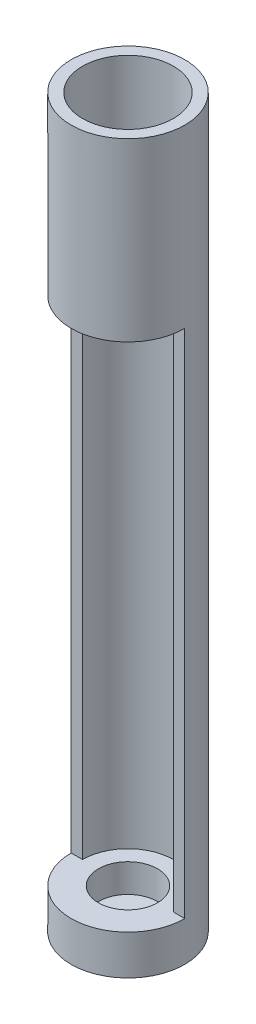
ISO-10303-21;
HEADER;
FILE_DESCRIPTION(('STEP AP214'),'2;1');
FILE_NAME('part.step','',(''),(''),'','','');
FILE_SCHEMA(('AUTOMOTIVE_DESIGN { 1 0 10303 214 1 1 1 1 }'));
ENDSEC;
DATA;
#1=APPLICATION_CONTEXT('core data for automotive mechanical design processes');
#2=APPLICATION_PROTOCOL_DEFINITION('international standard','automotive_design',2000,#1);
#3=PRODUCT_CONTEXT('',#1,'mechanical');
#4=PRODUCT('Part','Part','',(#3));
#5=PRODUCT_RELATED_PRODUCT_CATEGORY('part','',(#4));
#6=PRODUCT_DEFINITION_FORMATION('','',#4);
#7=PRODUCT_DEFINITION_CONTEXT('part definition',#1,'design');
#8=PRODUCT_DEFINITION('design','',#6,#7);
#9=PRODUCT_DEFINITION_SHAPE('','',#8);
#10=(LENGTH_UNIT() NAMED_UNIT(*) SI_UNIT(.MILLI.,.METRE.));
#11=(NAMED_UNIT(*) PLANE_ANGLE_UNIT() SI_UNIT($,.RADIAN.));
#12=(NAMED_UNIT(*) SI_UNIT($,.STERADIAN.) SOLID_ANGLE_UNIT());
#13=UNCERTAINTY_MEASURE_WITH_UNIT(LENGTH_MEASURE(1.E-05),#10,'distance_accuracy_value','');
#14=(GEOMETRIC_REPRESENTATION_CONTEXT(3) GLOBAL_UNCERTAINTY_ASSIGNED_CONTEXT((#13)) GLOBAL_UNIT_ASSIGNED_CONTEXT((#10,
#11,#12)) REPRESENTATION_CONTEXT('',''));
#15=CARTESIAN_POINT('',(0.,0.,0.));
#16=DIRECTION('',(0.,0.,1.));
#17=DIRECTION('',(1.,0.,0.));
#18=AXIS2_PLACEMENT_3D('',#15,#16,#17);
#19=CARTESIAN_POINT('',(0.,54.,0.));
#20=DIRECTION('',(0.,1.,0.));
#21=DIRECTION('',(0.,0.,1.));
#22=AXIS2_PLACEMENT_3D('',#19,#20,#21);
#23=PLANE('',#22);
#24=CARTESIAN_POINT('',(0.,54.,0.));
#25=DIRECTION('',(0.,1.,0.));
#26=DIRECTION('',(0.,0.,1.));
#27=AXIS2_PLACEMENT_3D('',#24,#25,#26);
#28=CIRCLE('',#27,2.6);
#29=CARTESIAN_POINT('',(0.,54.,2.6));
#30=VERTEX_POINT('',#29);
#31=EDGE_CURVE('E492',#30,#30,#28,.T.);
#32=ORIENTED_EDGE('',*,*,#31,.F.);
#33=EDGE_LOOP('',(#32));
#34=FACE_BOUND('',#33,.T.);
#35=CARTESIAN_POINT('',(0.,54.,3.));
#36=DIRECTION('',(0.,-1.,0.));
#37=DIRECTION('',(0.,0.,-1.));
#38=AXIS2_PLACEMENT_3D('',#35,#36,#37);
#39=CIRCLE('',#38,0.2);
#40=CARTESIAN_POINT('',(0.,54.,2.8));
#41=VERTEX_POINT('',#40);
#42=EDGE_CURVE('E520',#41,#41,#39,.T.);
#43=ORIENTED_EDGE('',*,*,#42,.T.);
#44=EDGE_LOOP('',(#43));
#45=FACE_BOUND('',#44,.T.);
#46=CARTESIAN_POINT('',(-2.59807621135332,54.,1.49999999999999));
#47=DIRECTION('',(0.,-1.,0.));
#48=DIRECTION('',(0.86602540378444,0.,-0.499999999999998));
#49=AXIS2_PLACEMENT_3D('',#46,#47,#48);
#50=CIRCLE('',#49,0.2);
#51=CARTESIAN_POINT('',(-2.42487113059643,54.,1.39999999999999));
#52=VERTEX_POINT('',#51);
#53=EDGE_CURVE('E538',#52,#52,#50,.T.);
#54=ORIENTED_EDGE('',*,*,#53,.T.);
#55=EDGE_LOOP('',(#54));
#56=FACE_BOUND('',#55,.T.);
#57=CARTESIAN_POINT('',(-2.59807621135331,54.,-1.50000000000001));
#58=DIRECTION('',(0.,-1.,0.));
#59=DIRECTION('',(0.866025403784436,0.,0.500000000000004));
#60=AXIS2_PLACEMENT_3D('',#57,#58,#59);
#61=CIRCLE('',#60,0.2);
#62=CARTESIAN_POINT('',(-2.42487113059642,54.,-1.40000000000001));
#63=VERTEX_POINT('',#62);
#64=EDGE_CURVE('E541',#63,#63,#61,.T.);
#65=ORIENTED_EDGE('',*,*,#64,.T.);
#66=EDGE_LOOP('',(#65));
#67=FACE_BOUND('',#66,.T.);
#68=CARTESIAN_POINT('',(0.,54.,-3.));
#69=DIRECTION('',(0.,-1.,0.));
#70=DIRECTION('',(0.,0.,1.));
#71=AXIS2_PLACEMENT_3D('',#68,#69,#70);
#72=CIRCLE('',#71,0.2);
#73=CARTESIAN_POINT('',(0.,54.,-2.8));
#74=VERTEX_POINT('',#73);
#75=EDGE_CURVE('E549',#74,#74,#72,.T.);
#76=ORIENTED_EDGE('',*,*,#75,.T.);
#77=EDGE_LOOP('',(#76));
#78=FACE_BOUND('',#77,.T.);
#79=CARTESIAN_POINT('',(2.59807621135333,54.,-1.49999999999998));
#80=DIRECTION('',(0.,-1.,0.));
#81=DIRECTION('',(-0.866025403784443,0.,0.499999999999992));
#82=AXIS2_PLACEMENT_3D('',#79,#80,#81);
#83=CIRCLE('',#82,0.2);
#84=CARTESIAN_POINT('',(2.42487113059644,54.,-1.39999999999998));
#85=VERTEX_POINT('',#84);
#86=EDGE_CURVE('E545',#85,#85,#83,.T.);
#87=ORIENTED_EDGE('',*,*,#86,.T.);
#88=EDGE_LOOP('',(#87));
#89=FACE_BOUND('',#88,.T.);
#90=CARTESIAN_POINT('',(2.5980762113533,54.,1.50000000000003));
#91=DIRECTION('',(0.,-1.,0.));
#92=DIRECTION('',(-0.866025403784433,0.,-0.50000000000001));
#93=AXIS2_PLACEMENT_3D('',#90,#91,#92);
#94=CIRCLE('',#93,0.2);
#95=CARTESIAN_POINT('',(2.42487113059641,54.,1.40000000000003));
#96=VERTEX_POINT('',#95);
#97=EDGE_CURVE('E542',#96,#96,#94,.T.);
#98=ORIENTED_EDGE('',*,*,#97,.T.);
#99=EDGE_LOOP('',(#98));
#100=FACE_BOUND('',#99,.T.);
#101=CARTESIAN_POINT('',(0.,54.,0.));
#102=DIRECTION('',(0.,1.,0.));
#103=DIRECTION('',(0.,0.,1.));
#104=AXIS2_PLACEMENT_3D('',#101,#102,#103);
#105=CIRCLE('',#104,4.);
#106=CARTESIAN_POINT('',(0.,54.,4.));
#107=VERTEX_POINT('',#106);
#108=EDGE_CURVE('E11',#107,#107,#105,.F.);
#109=ORIENTED_EDGE('',*,*,#108,.F.);
#110=EDGE_LOOP('',(#109));
#111=FACE_BOUND('',#110,.T.);
#112=ADVANCED_FACE('F39',(#34,#45,#56,#67,#78,#89,#100,#111),#23,.T.);
#113=CARTESIAN_POINT('',(0.,51.5,0.));
#114=DIRECTION('',(0.,1.,0.));
#115=DIRECTION('',(0.,0.,1.));
#116=AXIS2_PLACEMENT_3D('',#113,#114,#115);
#117=PLANE('',#116);
#118=CARTESIAN_POINT('',(0.,51.5,0.));
#119=DIRECTION('',(0.,1.,0.));
#120=DIRECTION('',(0.,0.,1.));
#121=AXIS2_PLACEMENT_3D('',#118,#119,#120);
#122=CIRCLE('',#121,1.3);
#123=CARTESIAN_POINT('',(0.,51.5,1.3));
#124=VERTEX_POINT('',#123);
#125=EDGE_CURVE('E467',#124,#124,#122,.T.);
#126=ORIENTED_EDGE('',*,*,#125,.F.);
#127=EDGE_LOOP('',(#126));
#128=FACE_BOUND('',#127,.T.);
#129=CARTESIAN_POINT('',(0.,51.5,0.));
#130=DIRECTION('',(0.,1.,0.));
#131=DIRECTION('',(0.,0.,1.));
#132=AXIS2_PLACEMENT_3D('',#129,#130,#131);
#133=CIRCLE('',#132,2.6);
#134=CARTESIAN_POINT('',(0.,51.5,2.6));
#135=VERTEX_POINT('',#134);
#136=EDGE_CURVE('E512',#135,#135,#133,.T.);
#137=ORIENTED_EDGE('',*,*,#136,.T.);
#138=EDGE_LOOP('',(#137));
#139=FACE_BOUND('',#138,.T.);
#140=ADVANCED_FACE('F140',(#128,#139),#117,.T.);
#141=CARTESIAN_POINT('',(0.,3.5,0.));
#142=DIRECTION('',(0.,-1.,0.));
#143=DIRECTION('',(0.,0.,-1.));
#144=AXIS2_PLACEMENT_3D('',#141,#142,#143);
#145=CYLINDRICAL_SURFACE('',#144,5.);
#146=CARTESIAN_POINT('',(0.,3.5,0.));
#147=DIRECTION('',(0.,1.,0.));
#148=DIRECTION('',(0.,0.,1.));
#149=AXIS2_PLACEMENT_3D('',#146,#147,#148);
#150=CIRCLE('',#149,5.);
#151=CARTESIAN_POINT('',(-5.,3.5,0.));
#152=VERTEX_POINT('',#151);
#153=CARTESIAN_POINT('',(5.,3.5,0.));
#154=VERTEX_POINT('',#153);
#155=EDGE_CURVE('E47',#152,#154,#150,.T.);
#156=ORIENTED_EDGE('',*,*,#155,.F.);
#157=DIRECTION('',(0.,-1.,0.));
#158=VECTOR('',#157,1.);
#159=CARTESIAN_POINT('',(-5.,48.5,0.));
#160=LINE('',#159,#158);
#161=CARTESIAN_POINT('',(-5.,48.5,0.));
#162=VERTEX_POINT('',#161);
#163=EDGE_CURVE('E63',#162,#152,#160,.T.);
#164=ORIENTED_EDGE('',*,*,#163,.F.);
#165=CARTESIAN_POINT('',(0.,48.5,0.));
#166=DIRECTION('',(0.,1.,0.));
#167=DIRECTION('',(0.,0.,1.));
#168=AXIS2_PLACEMENT_3D('',#165,#166,#167);
#169=CIRCLE('',#168,5.);
#170=CARTESIAN_POINT('',(5.,48.5,0.));
#171=VERTEX_POINT('',#170);
#172=EDGE_CURVE('E100',#162,#171,#169,.T.);
#173=ORIENTED_EDGE('',*,*,#172,.T.);
#174=DIRECTION('',(0.,-1.,0.));
#175=VECTOR('',#174,1.);
#176=CARTESIAN_POINT('',(5.,48.5,0.));
#177=LINE('',#176,#175);
#178=EDGE_CURVE('E110',#171,#154,#177,.T.);
#179=ORIENTED_EDGE('',*,*,#178,.T.);
#180=EDGE_LOOP('',(#156,#164,#173,#179));
#181=FACE_BOUND('',#180,.T.);
#182=CARTESIAN_POINT('',(0.,0.,0.));
#183=DIRECTION('',(0.,1.,0.));
#184=DIRECTION('',(0.,0.,1.));
#185=AXIS2_PLACEMENT_3D('',#182,#183,#184);
#186=CIRCLE('',#185,5.);
#187=CARTESIAN_POINT('',(0.,0.,5.));
#188=VERTEX_POINT('',#187);
#189=EDGE_CURVE('E117',#188,#188,#186,.T.);
#190=ORIENTED_EDGE('',*,*,#189,.T.);
#191=EDGE_LOOP('',(#190));
#192=FACE_BOUND('',#191,.T.);
#193=CARTESIAN_POINT('',(0.,64.,0.));
#194=DIRECTION('',(0.,1.,0.));
#195=DIRECTION('',(0.,0.,1.));
#196=AXIS2_PLACEMENT_3D('',#193,#194,#195);
#197=CIRCLE('',#196,5.);
#198=CARTESIAN_POINT('',(0.,64.,5.));
#199=VERTEX_POINT('',#198);
#200=EDGE_CURVE('E546',#199,#199,#197,.T.);
#201=ORIENTED_EDGE('',*,*,#200,.F.);
#202=EDGE_LOOP('',(#201));
#203=FACE_BOUND('',#202,.T.);
#204=ADVANCED_FACE('F41',(#181,#192,#203),#145,.T.);
#205=CARTESIAN_POINT('',(0.,3.5,0.));
#206=DIRECTION('',(0.,1.,0.));
#207=DIRECTION('',(0.,0.,1.));
#208=AXIS2_PLACEMENT_3D('',#205,#206,#207);
#209=PLANE('',#208);
#210=DIRECTION('',(1.,0.,0.));
#211=VECTOR('',#210,1.);
#212=CARTESIAN_POINT('',(0.,3.5,0.));
#213=LINE('',#212,#211);
#214=CARTESIAN_POINT('',(-4.,3.5,0.));
#215=VERTEX_POINT('',#214);
#216=EDGE_CURVE('E90',#152,#215,#213,.T.);
#217=ORIENTED_EDGE('',*,*,#216,.F.);
#218=ORIENTED_EDGE('',*,*,#155,.T.);
#219=DIRECTION('',(-1.,0.,0.));
#220=VECTOR('',#219,1.);
#221=CARTESIAN_POINT('',(0.,3.5,0.));
#222=LINE('',#221,#220);
#223=CARTESIAN_POINT('',(4.,3.5,0.));
#224=VERTEX_POINT('',#223);
#225=EDGE_CURVE('E105',#154,#224,#222,.T.);
#226=ORIENTED_EDGE('',*,*,#225,.T.);
#227=CARTESIAN_POINT('',(0.,3.5,0.));
#228=DIRECTION('',(0.,1.,0.));
#229=DIRECTION('',(0.,0.,1.));
#230=AXIS2_PLACEMENT_3D('',#227,#228,#229);
#231=CIRCLE('',#230,4.);
#232=EDGE_CURVE('E54',#224,#215,#231,.T.);
#233=ORIENTED_EDGE('',*,*,#232,.T.);
#234=EDGE_LOOP('',(#217,#218,#226,#233));
#235=FACE_BOUND('',#234,.T.);
#236=CARTESIAN_POINT('',(0.,3.5,0.));
#237=DIRECTION('',(0.,1.,0.));
#238=DIRECTION('',(0.,0.,1.));
#239=AXIS2_PLACEMENT_3D('',#236,#237,#238);
#240=CIRCLE('',#239,2.6);
#241=CARTESIAN_POINT('',(0.,3.5,2.6));
#242=VERTEX_POINT('',#241);
#243=EDGE_CURVE('E113',#242,#242,#240,.T.);
#244=ORIENTED_EDGE('',*,*,#243,.F.);
#245=EDGE_LOOP('',(#244));
#246=FACE_BOUND('',#245,.T.);
#247=ADVANCED_FACE('F129',(#235,#246),#209,.T.);
#248=CARTESIAN_POINT('',(0.,0.,0.));
#249=DIRECTION('',(0.,1.,0.));
#250=DIRECTION('',(0.,0.,1.));
#251=AXIS2_PLACEMENT_3D('',#248,#249,#250);
#252=PLANE('',#251);
#253=ORIENTED_EDGE('',*,*,#189,.F.);
#254=EDGE_LOOP('',(#253));
#255=FACE_BOUND('',#254,.T.);
#256=ADVANCED_FACE('F126',(#255),#252,.F.);
#257=CARTESIAN_POINT('',(0.,1.,0.));
#258=DIRECTION('',(0.,1.,0.));
#259=DIRECTION('',(0.,0.,1.));
#260=AXIS2_PLACEMENT_3D('',#257,#258,#259);
#261=CYLINDRICAL_SURFACE('',#260,2.6);
#262=CARTESIAN_POINT('',(0.,1.,0.));
#263=DIRECTION('',(0.,1.,0.));
#264=DIRECTION('',(0.,0.,1.));
#265=AXIS2_PLACEMENT_3D('',#262,#263,#264);
#266=CIRCLE('',#265,2.6);
#267=CARTESIAN_POINT('',(0.,1.,2.6));
#268=VERTEX_POINT('',#267);
#269=EDGE_CURVE('E114',#268,#268,#266,.T.);
#270=ORIENTED_EDGE('',*,*,#269,.F.);
#271=EDGE_LOOP('',(#270));
#272=FACE_BOUND('',#271,.T.);
#273=ORIENTED_EDGE('',*,*,#243,.T.);
#274=EDGE_LOOP('',(#273));
#275=FACE_BOUND('',#274,.T.);
#276=ADVANCED_FACE('F128',(#272,#275),#261,.F.);
#277=CARTESIAN_POINT('',(0.,1.,0.));
#278=DIRECTION('',(0.,1.,0.));
#279=DIRECTION('',(0.,0.,1.));
#280=AXIS2_PLACEMENT_3D('',#277,#278,#279);
#281=PLANE('',#280);
#282=ORIENTED_EDGE('',*,*,#269,.T.);
#283=EDGE_LOOP('',(#282));
#284=FACE_BOUND('',#283,.T.);
#285=ADVANCED_FACE('F134',(#284),#281,.T.);
#286=CARTESIAN_POINT('',(0.,48.5,0.));
#287=DIRECTION('',(0.,-1.,0.));
#288=DIRECTION('',(0.,0.,-1.));
#289=AXIS2_PLACEMENT_3D('',#286,#287,#288);
#290=CYLINDRICAL_SURFACE('',#289,4.);
#291=ORIENTED_EDGE('',*,*,#232,.F.);
#292=DIRECTION('',(0.,-1.,0.));
#293=VECTOR('',#292,1.);
#294=CARTESIAN_POINT('',(4.,48.5,0.));
#295=LINE('',#294,#293);
#296=CARTESIAN_POINT('',(4.,48.5,0.));
#297=VERTEX_POINT('',#296);
#298=EDGE_CURVE('E80',#297,#224,#295,.T.);
#299=ORIENTED_EDGE('',*,*,#298,.F.);
#300=CARTESIAN_POINT('',(0.,48.5,0.));
#301=DIRECTION('',(0.,1.,0.));
#302=DIRECTION('',(0.,0.,1.));
#303=AXIS2_PLACEMENT_3D('',#300,#301,#302);
#304=CIRCLE('',#303,4.);
#305=CARTESIAN_POINT('',(-4.,48.5,0.));
#306=VERTEX_POINT('',#305);
#307=EDGE_CURVE('E84',#297,#306,#304,.T.);
#308=ORIENTED_EDGE('',*,*,#307,.T.);
#309=DIRECTION('',(0.,-1.,0.));
#310=VECTOR('',#309,1.);
#311=CARTESIAN_POINT('',(-4.,48.5,0.));
#312=LINE('',#311,#310);
#313=EDGE_CURVE('E78',#306,#215,#312,.T.);
#314=ORIENTED_EDGE('',*,*,#313,.T.);
#315=EDGE_LOOP('',(#291,#299,#308,#314));
#316=FACE_BOUND('',#315,.T.);
#317=ADVANCED_FACE('F85',(#316),#290,.F.);
#318=CARTESIAN_POINT('',(0.,48.5,0.));
#319=DIRECTION('',(0.,0.,1.));
#320=DIRECTION('',(1.,0.,0.));
#321=AXIS2_PLACEMENT_3D('',#318,#319,#320);
#322=PLANE('',#321);
#323=ORIENTED_EDGE('',*,*,#225,.F.);
#324=ORIENTED_EDGE('',*,*,#178,.F.);
#325=DIRECTION('',(-1.,0.,0.));
#326=VECTOR('',#325,1.);
#327=CARTESIAN_POINT('',(0.,48.5,0.));
#328=LINE('',#327,#326);
#329=EDGE_CURVE('E89',#171,#297,#328,.T.);
#330=ORIENTED_EDGE('',*,*,#329,.T.);
#331=ORIENTED_EDGE('',*,*,#298,.T.);
#332=EDGE_LOOP('',(#323,#324,#330,#331));
#333=FACE_BOUND('',#332,.T.);
#334=ADVANCED_FACE('F211',(#333),#322,.T.);
#335=CARTESIAN_POINT('',(0.,48.5,0.));
#336=DIRECTION('',(0.,0.,-1.));
#337=DIRECTION('',(-1.,0.,0.));
#338=AXIS2_PLACEMENT_3D('',#335,#336,#337);
#339=PLANE('',#338);
#340=ORIENTED_EDGE('',*,*,#216,.T.);
#341=ORIENTED_EDGE('',*,*,#313,.F.);
#342=DIRECTION('',(1.,0.,0.));
#343=VECTOR('',#342,1.);
#344=CARTESIAN_POINT('',(0.,48.5,0.));
#345=LINE('',#344,#343);
#346=EDGE_CURVE('E94',#162,#306,#345,.T.);
#347=ORIENTED_EDGE('',*,*,#346,.F.);
#348=ORIENTED_EDGE('',*,*,#163,.T.);
#349=EDGE_LOOP('',(#340,#341,#347,#348));
#350=FACE_BOUND('',#349,.T.);
#351=ADVANCED_FACE('F93',(#350),#339,.F.);
#352=CARTESIAN_POINT('',(0.,48.5,0.));
#353=DIRECTION('',(0.,1.,0.));
#354=DIRECTION('',(0.,0.,1.));
#355=AXIS2_PLACEMENT_3D('',#352,#353,#354);
#356=PLANE('',#355);
#357=CARTESIAN_POINT('',(2.16506350946108,48.5,1.25000000000003));
#358=DIRECTION('',(0.,-1.,0.));
#359=DIRECTION('',(-0.866025403784433,0.,-0.50000000000001));
#360=AXIS2_PLACEMENT_3D('',#357,#358,#359);
#361=CIRCLE('',#360,1.);
#362=CARTESIAN_POINT('',(1.29903810567665,48.5,0.750000000000015));
#363=VERTEX_POINT('',#362);
#364=EDGE_CURVE('E488',#363,#363,#361,.T.);
#365=ORIENTED_EDGE('',*,*,#364,.F.);
#366=EDGE_LOOP('',(#365));
#367=FACE_BOUND('',#366,.T.);
#368=CARTESIAN_POINT('',(2.16506350946111,48.5,-1.24999999999998));
#369=DIRECTION('',(0.,-1.,0.));
#370=DIRECTION('',(-0.866025403784443,0.,0.499999999999992));
#371=AXIS2_PLACEMENT_3D('',#368,#369,#370);
#372=CIRCLE('',#371,1.);
#373=CARTESIAN_POINT('',(1.29903810567667,48.5,-0.749999999999988));
#374=VERTEX_POINT('',#373);
#375=EDGE_CURVE('E495',#374,#374,#372,.T.);
#376=ORIENTED_EDGE('',*,*,#375,.F.);
#377=EDGE_LOOP('',(#376));
#378=FACE_BOUND('',#377,.T.);
#379=CARTESIAN_POINT('',(0.,48.5,-2.5));
#380=DIRECTION('',(0.,-1.,0.));
#381=DIRECTION('',(0.,0.,1.));
#382=AXIS2_PLACEMENT_3D('',#379,#380,#381);
#383=CIRCLE('',#382,1.);
#384=CARTESIAN_POINT('',(0.,48.5,-1.5));
#385=VERTEX_POINT('',#384);
#386=EDGE_CURVE('E501',#385,#385,#383,.T.);
#387=ORIENTED_EDGE('',*,*,#386,.F.);
#388=EDGE_LOOP('',(#387));
#389=FACE_BOUND('',#388,.T.);
#390=CARTESIAN_POINT('',(-2.16506350946109,48.5,-1.25000000000001));
#391=DIRECTION('',(0.,-1.,0.));
#392=DIRECTION('',(0.866025403784436,0.,0.500000000000004));
#393=AXIS2_PLACEMENT_3D('',#390,#391,#392);
#394=CIRCLE('',#393,1.);
#395=CARTESIAN_POINT('',(-1.29903810567665,48.5,-0.750000000000006));
#396=VERTEX_POINT('',#395);
#397=EDGE_CURVE('E507',#396,#396,#394,.T.);
#398=ORIENTED_EDGE('',*,*,#397,.F.);
#399=EDGE_LOOP('',(#398));
#400=FACE_BOUND('',#399,.T.);
#401=CARTESIAN_POINT('',(-2.1650635094611,48.5,1.25));
#402=DIRECTION('',(0.,-1.,0.));
#403=DIRECTION('',(0.86602540378444,0.,-0.499999999999998));
#404=AXIS2_PLACEMENT_3D('',#401,#402,#403);
#405=CIRCLE('',#404,1.);
#406=CARTESIAN_POINT('',(-1.29903810567666,48.5,0.749999999999997));
#407=VERTEX_POINT('',#406);
#408=EDGE_CURVE('E482',#407,#407,#405,.T.);
#409=ORIENTED_EDGE('',*,*,#408,.F.);
#410=EDGE_LOOP('',(#409));
#411=FACE_BOUND('',#410,.T.);
#412=CARTESIAN_POINT('',(0.,48.5,2.5));
#413=DIRECTION('',(0.,-1.,0.));
#414=DIRECTION('',(0.,0.,-1.));
#415=AXIS2_PLACEMENT_3D('',#412,#413,#414);
#416=CIRCLE('',#415,1.);
#417=CARTESIAN_POINT('',(0.,48.5,1.5));
#418=VERTEX_POINT('',#417);
#419=EDGE_CURVE('E476',#418,#418,#416,.T.);
#420=ORIENTED_EDGE('',*,*,#419,.F.);
#421=EDGE_LOOP('',(#420));
#422=FACE_BOUND('',#421,.T.);
#423=ORIENTED_EDGE('',*,*,#329,.F.);
#424=ORIENTED_EDGE('',*,*,#172,.F.);
#425=ORIENTED_EDGE('',*,*,#346,.T.);
#426=ORIENTED_EDGE('',*,*,#307,.F.);
#427=EDGE_LOOP('',(#423,#424,#425,#426));
#428=FACE_BOUND('',#427,.T.);
#429=CARTESIAN_POINT('',(0.,48.5,0.));
#430=DIRECTION('',(0.,1.,0.));
#431=DIRECTION('',(0.,0.,1.));
#432=AXIS2_PLACEMENT_3D('',#429,#430,#431);
#433=CIRCLE('',#432,1.3);
#434=CARTESIAN_POINT('',(0.,48.5,1.3));
#435=VERTEX_POINT('',#434);
#436=EDGE_CURVE('E470',#435,#435,#433,.T.);
#437=ORIENTED_EDGE('',*,*,#436,.T.);
#438=EDGE_LOOP('',(#437));
#439=FACE_BOUND('',#438,.T.);
#440=ADVANCED_FACE('F98',(#367,#378,#389,#400,#411,#422,#428,#439),#356,.F.);
#441=CARTESIAN_POINT('',(0.,51.5,0.));
#442=DIRECTION('',(0.,-1.,0.));
#443=DIRECTION('',(0.,0.,-1.));
#444=AXIS2_PLACEMENT_3D('',#441,#442,#443);
#445=CYLINDRICAL_SURFACE('',#444,1.3);
#446=ORIENTED_EDGE('',*,*,#125,.T.);
#447=EDGE_LOOP('',(#446));
#448=FACE_BOUND('',#447,.T.);
#449=ORIENTED_EDGE('',*,*,#436,.F.);
#450=EDGE_LOOP('',(#449));
#451=FACE_BOUND('',#450,.T.);
#452=ADVANCED_FACE('F201',(#448,#451),#445,.F.);
#453=CARTESIAN_POINT('',(0.,50.5,2.5));
#454=DIRECTION('',(0.,-1.,0.));
#455=DIRECTION('',(0.,0.,-1.));
#456=AXIS2_PLACEMENT_3D('',#453,#454,#455);
#457=CYLINDRICAL_SURFACE('',#456,1.);
#458=CARTESIAN_POINT('',(0.,50.5,2.5));
#459=DIRECTION('',(0.,-1.,0.));
#460=DIRECTION('',(0.,0.,-1.));
#461=AXIS2_PLACEMENT_3D('',#458,#459,#460);
#462=CIRCLE('',#461,1.);
#463=CARTESIAN_POINT('',(0.,50.5,1.5));
#464=VERTEX_POINT('',#463);
#465=EDGE_CURVE('E474',#464,#464,#462,.T.);
#466=ORIENTED_EDGE('',*,*,#465,.F.);
#467=EDGE_LOOP('',(#466));
#468=FACE_BOUND('',#467,.T.);
#469=ORIENTED_EDGE('',*,*,#419,.T.);
#470=EDGE_LOOP('',(#469));
#471=FACE_BOUND('',#470,.T.);
#472=ADVANCED_FACE('F197',(#468,#471),#457,.F.);
#473=CARTESIAN_POINT('',(0.,50.5,2.5));
#474=DIRECTION('',(0.,-1.,0.));
#475=DIRECTION('',(0.,0.,-1.));
#476=AXIS2_PLACEMENT_3D('',#473,#474,#475);
#477=PLANE('',#476);
#478=CARTESIAN_POINT('',(0.,50.5,3.));
#479=DIRECTION('',(0.,-1.,0.));
#480=DIRECTION('',(0.,0.,-1.));
#481=AXIS2_PLACEMENT_3D('',#478,#479,#480);
#482=CIRCLE('',#481,0.2);
#483=CARTESIAN_POINT('',(0.,50.5,2.8));
#484=VERTEX_POINT('',#483);
#485=EDGE_CURVE('E515',#484,#484,#482,.T.);
#486=ORIENTED_EDGE('',*,*,#485,.F.);
#487=EDGE_LOOP('',(#486));
#488=FACE_BOUND('',#487,.T.);
#489=ORIENTED_EDGE('',*,*,#465,.T.);
#490=EDGE_LOOP('',(#489));
#491=FACE_BOUND('',#490,.T.);
#492=ADVANCED_FACE('F193',(#488,#491),#477,.T.);
#493=CARTESIAN_POINT('',(-2.1650635094611,50.5,1.25));
#494=DIRECTION('',(0.,-1.,0.));
#495=DIRECTION('',(0.,0.,-1.));
#496=AXIS2_PLACEMENT_3D('',#493,#494,#495);
#497=CYLINDRICAL_SURFACE('',#496,1.);
#498=CARTESIAN_POINT('',(-2.1650635094611,50.5,1.25));
#499=DIRECTION('',(0.,-1.,0.));
#500=DIRECTION('',(0.86602540378444,0.,-0.499999999999998));
#501=AXIS2_PLACEMENT_3D('',#498,#499,#500);
#502=CIRCLE('',#501,1.);
#503=CARTESIAN_POINT('',(-1.29903810567666,50.5,0.749999999999997));
#504=VERTEX_POINT('',#503);
#505=EDGE_CURVE('E479',#504,#504,#502,.T.);
#506=ORIENTED_EDGE('',*,*,#505,.F.);
#507=EDGE_LOOP('',(#506));
#508=FACE_BOUND('',#507,.T.);
#509=ORIENTED_EDGE('',*,*,#408,.T.);
#510=EDGE_LOOP('',(#509));
#511=FACE_BOUND('',#510,.T.);
#512=ADVANCED_FACE('F189',(#508,#511),#497,.F.);
#513=CARTESIAN_POINT('',(-2.1650635094611,50.5,1.25));
#514=DIRECTION('',(0.,-1.,0.));
#515=DIRECTION('',(0.86602540378444,0.,-0.499999999999998));
#516=AXIS2_PLACEMENT_3D('',#513,#514,#515);
#517=PLANE('',#516);
#518=CARTESIAN_POINT('',(-2.59807621135332,50.5,1.49999999999999));
#519=DIRECTION('',(0.,-1.,0.));
#520=DIRECTION('',(0.,0.,-1.));
#521=AXIS2_PLACEMENT_3D('',#518,#519,#520);
#522=CIRCLE('',#521,0.2);
#523=CARTESIAN_POINT('',(-2.59807621135332,50.5,1.29999999999999));
#524=VERTEX_POINT('',#523);
#525=EDGE_CURVE('E535',#524,#524,#522,.T.);
#526=ORIENTED_EDGE('',*,*,#525,.F.);
#527=EDGE_LOOP('',(#526));
#528=FACE_BOUND('',#527,.T.);
#529=ORIENTED_EDGE('',*,*,#505,.T.);
#530=EDGE_LOOP('',(#529));
#531=FACE_BOUND('',#530,.T.);
#532=ADVANCED_FACE('F162',(#528,#531),#517,.T.);
#533=CARTESIAN_POINT('',(-2.16506350946109,50.5,-1.25000000000001));
#534=DIRECTION('',(0.,-1.,0.));
#535=DIRECTION('',(0.,0.,-1.));
#536=AXIS2_PLACEMENT_3D('',#533,#534,#535);
#537=CYLINDRICAL_SURFACE('',#536,1.);
#538=CARTESIAN_POINT('',(-2.16506350946109,50.5,-1.25000000000001));
#539=DIRECTION('',(0.,-1.,0.));
#540=DIRECTION('',(0.866025403784436,0.,0.500000000000004));
#541=AXIS2_PLACEMENT_3D('',#538,#539,#540);
#542=CIRCLE('',#541,1.);
#543=CARTESIAN_POINT('',(-1.29903810567665,50.5,-0.750000000000006));
#544=VERTEX_POINT('',#543);
#545=EDGE_CURVE('E485',#544,#544,#542,.T.);
#546=ORIENTED_EDGE('',*,*,#545,.F.);
#547=EDGE_LOOP('',(#546));
#548=FACE_BOUND('',#547,.T.);
#549=ORIENTED_EDGE('',*,*,#397,.T.);
#550=EDGE_LOOP('',(#549));
#551=FACE_BOUND('',#550,.T.);
#552=ADVANCED_FACE('F158',(#548,#551),#537,.F.);
#553=CARTESIAN_POINT('',(-2.16506350946109,50.5,-1.25000000000001));
#554=DIRECTION('',(0.,-1.,0.));
#555=DIRECTION('',(0.866025403784436,0.,0.500000000000004));
#556=AXIS2_PLACEMENT_3D('',#553,#554,#555);
#557=PLANE('',#556);
#558=CARTESIAN_POINT('',(-2.59807621135331,50.5,-1.50000000000001));
#559=DIRECTION('',(0.,-1.,0.));
#560=DIRECTION('',(0.,0.,-1.));
#561=AXIS2_PLACEMENT_3D('',#558,#559,#560);
#562=CIRCLE('',#561,0.2);
#563=CARTESIAN_POINT('',(-2.59807621135331,50.5,-1.70000000000001));
#564=VERTEX_POINT('',#563);
#565=EDGE_CURVE('E532',#564,#564,#562,.T.);
#566=ORIENTED_EDGE('',*,*,#565,.F.);
#567=EDGE_LOOP('',(#566));
#568=FACE_BOUND('',#567,.T.);
#569=ORIENTED_EDGE('',*,*,#545,.T.);
#570=EDGE_LOOP('',(#569));
#571=FACE_BOUND('',#570,.T.);
#572=ADVANCED_FACE('F154',(#568,#571),#557,.T.);
#573=CARTESIAN_POINT('',(0.,50.5,-2.5));
#574=DIRECTION('',(0.,-1.,0.));
#575=DIRECTION('',(0.,0.,-1.));
#576=AXIS2_PLACEMENT_3D('',#573,#574,#575);
#577=CYLINDRICAL_SURFACE('',#576,1.);
#578=CARTESIAN_POINT('',(0.,50.5,-2.5));
#579=DIRECTION('',(0.,-1.,0.));
#580=DIRECTION('',(0.,0.,1.));
#581=AXIS2_PLACEMENT_3D('',#578,#579,#580);
#582=CIRCLE('',#581,1.);
#583=CARTESIAN_POINT('',(0.,50.5,-1.5));
#584=VERTEX_POINT('',#583);
#585=EDGE_CURVE('E504',#584,#584,#582,.T.);
#586=ORIENTED_EDGE('',*,*,#585,.F.);
#587=EDGE_LOOP('',(#586));
#588=FACE_BOUND('',#587,.T.);
#589=ORIENTED_EDGE('',*,*,#386,.T.);
#590=EDGE_LOOP('',(#589));
#591=FACE_BOUND('',#590,.T.);
#592=ADVANCED_FACE('F157',(#588,#591),#577,.F.);
#593=CARTESIAN_POINT('',(0.,50.5,-2.5));
#594=DIRECTION('',(0.,-1.,0.));
#595=DIRECTION('',(0.,0.,1.));
#596=AXIS2_PLACEMENT_3D('',#593,#594,#595);
#597=PLANE('',#596);
#598=CARTESIAN_POINT('',(0.,50.5,-3.));
#599=DIRECTION('',(0.,-1.,0.));
#600=DIRECTION('',(0.,0.,-1.));
#601=AXIS2_PLACEMENT_3D('',#598,#599,#600);
#602=CIRCLE('',#601,0.2);
#603=CARTESIAN_POINT('',(0.,50.5,-3.2));
#604=VERTEX_POINT('',#603);
#605=EDGE_CURVE('E529',#604,#604,#602,.T.);
#606=ORIENTED_EDGE('',*,*,#605,.F.);
#607=EDGE_LOOP('',(#606));
#608=FACE_BOUND('',#607,.T.);
#609=ORIENTED_EDGE('',*,*,#585,.T.);
#610=EDGE_LOOP('',(#609));
#611=FACE_BOUND('',#610,.T.);
#612=ADVANCED_FACE('F164',(#608,#611),#597,.T.);
#613=CARTESIAN_POINT('',(2.16506350946111,50.5,-1.24999999999998));
#614=DIRECTION('',(0.,-1.,0.));
#615=DIRECTION('',(0.,0.,-1.));
#616=AXIS2_PLACEMENT_3D('',#613,#614,#615);
#617=CYLINDRICAL_SURFACE('',#616,1.);
#618=CARTESIAN_POINT('',(2.16506350946111,50.5,-1.24999999999998));
#619=DIRECTION('',(0.,-1.,0.));
#620=DIRECTION('',(-0.866025403784443,0.,0.499999999999992));
#621=AXIS2_PLACEMENT_3D('',#618,#619,#620);
#622=CIRCLE('',#621,1.);
#623=CARTESIAN_POINT('',(1.29903810567667,50.5,-0.749999999999988));
#624=VERTEX_POINT('',#623);
#625=EDGE_CURVE('E498',#624,#624,#622,.T.);
#626=ORIENTED_EDGE('',*,*,#625,.F.);
#627=EDGE_LOOP('',(#626));
#628=FACE_BOUND('',#627,.T.);
#629=ORIENTED_EDGE('',*,*,#375,.T.);
#630=EDGE_LOOP('',(#629));
#631=FACE_BOUND('',#630,.T.);
#632=ADVANCED_FACE('F167',(#628,#631),#617,.F.);
#633=CARTESIAN_POINT('',(2.16506350946111,50.5,-1.24999999999998));
#634=DIRECTION('',(0.,-1.,0.));
#635=DIRECTION('',(-0.866025403784443,0.,0.499999999999992));
#636=AXIS2_PLACEMENT_3D('',#633,#634,#635);
#637=PLANE('',#636);
#638=CARTESIAN_POINT('',(2.59807621135333,50.5,-1.49999999999998));
#639=DIRECTION('',(0.,-1.,0.));
#640=DIRECTION('',(0.,0.,-1.));
#641=AXIS2_PLACEMENT_3D('',#638,#639,#640);
#642=CIRCLE('',#641,0.2);
#643=CARTESIAN_POINT('',(2.59807621135333,50.5,-1.69999999999998));
#644=VERTEX_POINT('',#643);
#645=EDGE_CURVE('E526',#644,#644,#642,.T.);
#646=ORIENTED_EDGE('',*,*,#645,.F.);
#647=EDGE_LOOP('',(#646));
#648=FACE_BOUND('',#647,.T.);
#649=ORIENTED_EDGE('',*,*,#625,.T.);
#650=EDGE_LOOP('',(#649));
#651=FACE_BOUND('',#650,.T.);
#652=ADVANCED_FACE('F172',(#648,#651),#637,.T.);
#653=CARTESIAN_POINT('',(2.16506350946108,50.5,1.25000000000003));
#654=DIRECTION('',(0.,-1.,0.));
#655=DIRECTION('',(0.,0.,-1.));
#656=AXIS2_PLACEMENT_3D('',#653,#654,#655);
#657=CYLINDRICAL_SURFACE('',#656,1.);
#658=CARTESIAN_POINT('',(2.16506350946108,50.5,1.25000000000003));
#659=DIRECTION('',(0.,-1.,0.));
#660=DIRECTION('',(-0.866025403784433,0.,-0.50000000000001));
#661=AXIS2_PLACEMENT_3D('',#658,#659,#660);
#662=CIRCLE('',#661,1.);
#663=CARTESIAN_POINT('',(1.29903810567665,50.5,0.750000000000015));
#664=VERTEX_POINT('',#663);
#665=EDGE_CURVE('E491',#664,#664,#662,.T.);
#666=ORIENTED_EDGE('',*,*,#665,.F.);
#667=EDGE_LOOP('',(#666));
#668=FACE_BOUND('',#667,.T.);
#669=ORIENTED_EDGE('',*,*,#364,.T.);
#670=EDGE_LOOP('',(#669));
#671=FACE_BOUND('',#670,.T.);
#672=ADVANCED_FACE('F175',(#668,#671),#657,.F.);
#673=CARTESIAN_POINT('',(2.16506350946108,50.5,1.25000000000003));
#674=DIRECTION('',(0.,-1.,0.));
#675=DIRECTION('',(-0.866025403784433,0.,-0.50000000000001));
#676=AXIS2_PLACEMENT_3D('',#673,#674,#675);
#677=PLANE('',#676);
#678=CARTESIAN_POINT('',(2.5980762113533,50.5,1.50000000000003));
#679=DIRECTION('',(0.,-1.,0.));
#680=DIRECTION('',(0.,0.,-1.));
#681=AXIS2_PLACEMENT_3D('',#678,#679,#680);
#682=CIRCLE('',#681,0.2);
#683=CARTESIAN_POINT('',(2.5980762113533,50.5,1.30000000000003));
#684=VERTEX_POINT('',#683);
#685=EDGE_CURVE('E523',#684,#684,#682,.T.);
#686=ORIENTED_EDGE('',*,*,#685,.F.);
#687=EDGE_LOOP('',(#686));
#688=FACE_BOUND('',#687,.T.);
#689=ORIENTED_EDGE('',*,*,#665,.T.);
#690=EDGE_LOOP('',(#689));
#691=FACE_BOUND('',#690,.T.);
#692=ADVANCED_FACE('F180',(#688,#691),#677,.T.);
#693=CARTESIAN_POINT('',(0.,54.,0.));
#694=DIRECTION('',(0.,-1.,0.));
#695=DIRECTION('',(0.,0.,-1.));
#696=AXIS2_PLACEMENT_3D('',#693,#694,#695);
#697=CYLINDRICAL_SURFACE('',#696,2.6);
#698=ORIENTED_EDGE('',*,*,#31,.T.);
#699=EDGE_LOOP('',(#698));
#700=FACE_BOUND('',#699,.T.);
#701=ORIENTED_EDGE('',*,*,#136,.F.);
#702=EDGE_LOOP('',(#701));
#703=FACE_BOUND('',#702,.T.);
#704=ADVANCED_FACE('F152',(#700,#703),#697,.F.);
#705=CARTESIAN_POINT('',(0.,54.,3.));
#706=DIRECTION('',(0.,-1.,0.));
#707=DIRECTION('',(0.,0.,-1.));
#708=AXIS2_PLACEMENT_3D('',#705,#706,#707);
#709=CYLINDRICAL_SURFACE('',#708,0.2);
#710=ORIENTED_EDGE('',*,*,#485,.T.);
#711=EDGE_LOOP('',(#710));
#712=FACE_BOUND('',#711,.T.);
#713=ORIENTED_EDGE('',*,*,#42,.F.);
#714=EDGE_LOOP('',(#713));
#715=FACE_BOUND('',#714,.T.);
#716=ADVANCED_FACE('F305',(#712,#715),#709,.F.);
#717=CARTESIAN_POINT('',(-2.59807621135332,54.,1.49999999999999));
#718=DIRECTION('',(0.,-1.,0.));
#719=DIRECTION('',(0.,0.,-1.));
#720=AXIS2_PLACEMENT_3D('',#717,#718,#719);
#721=CYLINDRICAL_SURFACE('',#720,0.2);
#722=ORIENTED_EDGE('',*,*,#525,.T.);
#723=EDGE_LOOP('',(#722));
#724=FACE_BOUND('',#723,.T.);
#725=ORIENTED_EDGE('',*,*,#53,.F.);
#726=EDGE_LOOP('',(#725));
#727=FACE_BOUND('',#726,.T.);
#728=ADVANCED_FACE('F311',(#724,#727),#721,.F.);
#729=CARTESIAN_POINT('',(-2.59807621135331,54.,-1.50000000000001));
#730=DIRECTION('',(0.,-1.,0.));
#731=DIRECTION('',(0.,0.,-1.));
#732=AXIS2_PLACEMENT_3D('',#729,#730,#731);
#733=CYLINDRICAL_SURFACE('',#732,0.2);
#734=ORIENTED_EDGE('',*,*,#565,.T.);
#735=EDGE_LOOP('',(#734));
#736=FACE_BOUND('',#735,.T.);
#737=ORIENTED_EDGE('',*,*,#64,.F.);
#738=EDGE_LOOP('',(#737));
#739=FACE_BOUND('',#738,.T.);
#740=ADVANCED_FACE('F317',(#736,#739),#733,.F.);
#741=CARTESIAN_POINT('',(0.,54.,-3.));
#742=DIRECTION('',(0.,-1.,0.));
#743=DIRECTION('',(0.,0.,-1.));
#744=AXIS2_PLACEMENT_3D('',#741,#742,#743);
#745=CYLINDRICAL_SURFACE('',#744,0.2);
#746=ORIENTED_EDGE('',*,*,#605,.T.);
#747=EDGE_LOOP('',(#746));
#748=FACE_BOUND('',#747,.T.);
#749=ORIENTED_EDGE('',*,*,#75,.F.);
#750=EDGE_LOOP('',(#749));
#751=FACE_BOUND('',#750,.T.);
#752=ADVANCED_FACE('F325',(#748,#751),#745,.F.);
#753=CARTESIAN_POINT('',(2.59807621135333,54.,-1.49999999999998));
#754=DIRECTION('',(0.,-1.,0.));
#755=DIRECTION('',(0.,0.,-1.));
#756=AXIS2_PLACEMENT_3D('',#753,#754,#755);
#757=CYLINDRICAL_SURFACE('',#756,0.2);
#758=ORIENTED_EDGE('',*,*,#645,.T.);
#759=EDGE_LOOP('',(#758));
#760=FACE_BOUND('',#759,.T.);
#761=ORIENTED_EDGE('',*,*,#86,.F.);
#762=EDGE_LOOP('',(#761));
#763=FACE_BOUND('',#762,.T.);
#764=ADVANCED_FACE('F333',(#760,#763),#757,.F.);
#765=CARTESIAN_POINT('',(2.5980762113533,54.,1.50000000000003));
#766=DIRECTION('',(0.,-1.,0.));
#767=DIRECTION('',(0.,0.,-1.));
#768=AXIS2_PLACEMENT_3D('',#765,#766,#767);
#769=CYLINDRICAL_SURFACE('',#768,0.2);
#770=ORIENTED_EDGE('',*,*,#685,.T.);
#771=EDGE_LOOP('',(#770));
#772=FACE_BOUND('',#771,.T.);
#773=ORIENTED_EDGE('',*,*,#97,.F.);
#774=EDGE_LOOP('',(#773));
#775=FACE_BOUND('',#774,.T.);
#776=ADVANCED_FACE('F341',(#772,#775),#769,.F.);
#777=CARTESIAN_POINT('',(0.,64.,0.));
#778=DIRECTION('',(0.,1.,0.));
#779=DIRECTION('',(0.,0.,1.));
#780=AXIS2_PLACEMENT_3D('',#777,#778,#779);
#781=PLANE('',#780);
#782=ORIENTED_EDGE('',*,*,#200,.T.);
#783=EDGE_LOOP('',(#782));
#784=FACE_BOUND('',#783,.T.);
#785=CARTESIAN_POINT('',(0.,64.,0.));
#786=DIRECTION('',(0.,1.,0.));
#787=DIRECTION('',(0.,0.,1.));
#788=AXIS2_PLACEMENT_3D('',#785,#786,#787);
#789=CIRCLE('',#788,4.);
#790=CARTESIAN_POINT('',(0.,64.,4.));
#791=VERTEX_POINT('',#790);
#792=EDGE_CURVE('E556',#791,#791,#789,.T.);
#793=ORIENTED_EDGE('',*,*,#792,.F.);
#794=EDGE_LOOP('',(#793));
#795=FACE_BOUND('',#794,.T.);
#796=ADVANCED_FACE('F349',(#784,#795),#781,.T.);
#797=CARTESIAN_POINT('',(0.,64.,0.));
#798=DIRECTION('',(0.,-1.,0.));
#799=DIRECTION('',(0.,0.,-1.));
#800=AXIS2_PLACEMENT_3D('',#797,#798,#799);
#801=CYLINDRICAL_SURFACE('',#800,4.);
#802=ORIENTED_EDGE('',*,*,#792,.T.);
#803=EDGE_LOOP('',(#802));
#804=FACE_BOUND('',#803,.T.);
#805=ORIENTED_EDGE('',*,*,#108,.T.);
#806=EDGE_LOOP('',(#805));
#807=FACE_BOUND('',#806,.T.);
#808=ADVANCED_FACE('F357',(#804,#807),#801,.F.);
#809=CLOSED_SHELL('',(#112,#140,#204,#247,#256,#276,#285,#317,#334,#351,#440,#452,#472,#492,
#512,#532,#552,#572,#592,#612,#632,#652,#672,#692,#704,#716,#728,#740,#752,#764,#776,#796,#808));
#810=MANIFOLD_SOLID_BREP('B2',#809);
#811=ADVANCED_BREP_SHAPE_REPRESENTATION('',(#18,#810),#14);
#812=SHAPE_DEFINITION_REPRESENTATION(#9,#811);
ENDSEC;
END-ISO-10303-21;
